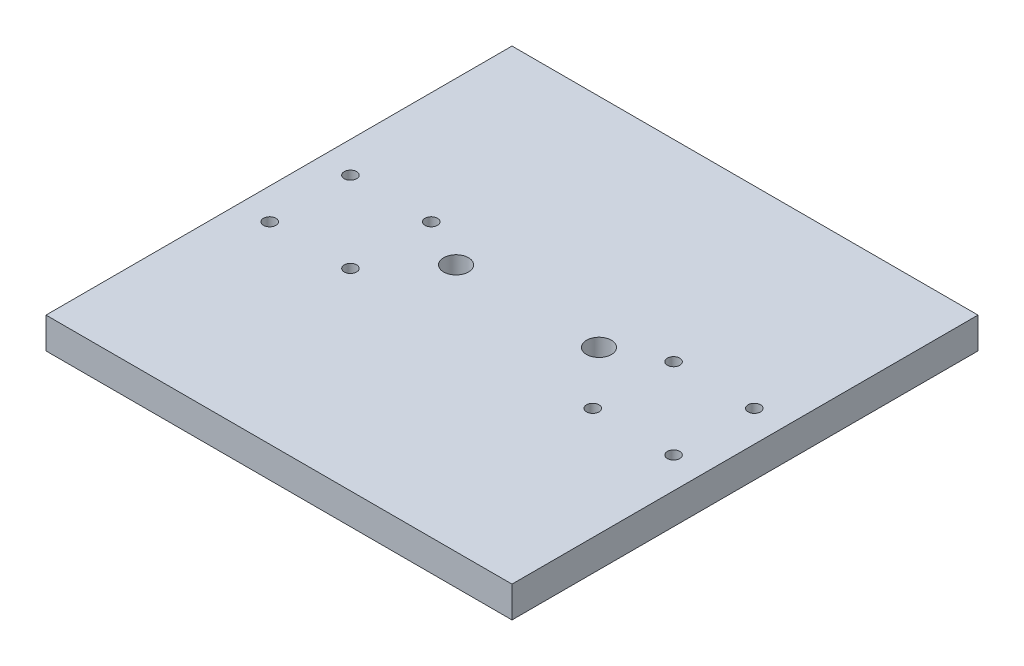
ISO-10303-21;
HEADER;
FILE_DESCRIPTION(('STEP AP214'),'2;1');
FILE_NAME('part.step','',(''),(''),'','','');
FILE_SCHEMA(('AUTOMOTIVE_DESIGN { 1 0 10303 214 1 1 1 1 }'));
ENDSEC;
DATA;
#1=APPLICATION_CONTEXT('core data for automotive mechanical design processes');
#2=APPLICATION_PROTOCOL_DEFINITION('international standard','automotive_design',2000,#1);
#3=PRODUCT_CONTEXT('',#1,'mechanical');
#4=PRODUCT('Part','Part','',(#3));
#5=PRODUCT_RELATED_PRODUCT_CATEGORY('part','',(#4));
#6=PRODUCT_DEFINITION_FORMATION('','',#4);
#7=PRODUCT_DEFINITION_CONTEXT('part definition',#1,'design');
#8=PRODUCT_DEFINITION('design','',#6,#7);
#9=PRODUCT_DEFINITION_SHAPE('','',#8);
#10=(LENGTH_UNIT() NAMED_UNIT(*) SI_UNIT(.MILLI.,.METRE.));
#11=(NAMED_UNIT(*) PLANE_ANGLE_UNIT() SI_UNIT($,.RADIAN.));
#12=(NAMED_UNIT(*) SI_UNIT($,.STERADIAN.) SOLID_ANGLE_UNIT());
#13=UNCERTAINTY_MEASURE_WITH_UNIT(LENGTH_MEASURE(1.E-05),#10,'distance_accuracy_value','');
#14=(GEOMETRIC_REPRESENTATION_CONTEXT(3) GLOBAL_UNCERTAINTY_ASSIGNED_CONTEXT((#13)) GLOBAL_UNIT_ASSIGNED_CONTEXT((#10,
#11,#12)) REPRESENTATION_CONTEXT('',''));
#15=CARTESIAN_POINT('',(0.,0.,0.));
#16=DIRECTION('',(0.,0.,1.));
#17=DIRECTION('',(1.,0.,0.));
#18=AXIS2_PLACEMENT_3D('',#15,#16,#17);
#19=CARTESIAN_POINT('',(75.,10.,-75.));
#20=DIRECTION('',(-1.,0.,0.));
#21=DIRECTION('',(0.,0.,1.));
#22=AXIS2_PLACEMENT_3D('',#19,#20,#21);
#23=PLANE('',#22);
#24=DIRECTION('',(0.,0.,-1.));
#25=VECTOR('',#24,1.);
#26=CARTESIAN_POINT('',(75.,0.,-75.));
#27=LINE('',#26,#25);
#28=CARTESIAN_POINT('',(75.,0.,75.));
#29=VERTEX_POINT('',#28);
#30=CARTESIAN_POINT('',(75.,0.,-75.));
#31=VERTEX_POINT('',#30);
#32=EDGE_CURVE('E101',#29,#31,#27,.T.);
#33=ORIENTED_EDGE('',*,*,#32,.T.);
#34=DIRECTION('',(0.,-1.,0.));
#35=VECTOR('',#34,1.);
#36=CARTESIAN_POINT('',(75.,10.,-75.));
#37=LINE('',#36,#35);
#38=CARTESIAN_POINT('',(75.,10.,-75.));
#39=VERTEX_POINT('',#38);
#40=EDGE_CURVE('E11',#39,#31,#37,.T.);
#41=ORIENTED_EDGE('',*,*,#40,.F.);
#42=DIRECTION('',(0.,0.,-1.));
#43=VECTOR('',#42,1.);
#44=CARTESIAN_POINT('',(75.,10.,-75.));
#45=LINE('',#44,#43);
#46=CARTESIAN_POINT('',(75.,10.,75.));
#47=VERTEX_POINT('',#46);
#48=EDGE_CURVE('E89',#47,#39,#45,.T.);
#49=ORIENTED_EDGE('',*,*,#48,.F.);
#50=DIRECTION('',(0.,-1.,0.));
#51=VECTOR('',#50,1.);
#52=CARTESIAN_POINT('',(75.,10.,75.));
#53=LINE('',#52,#51);
#54=EDGE_CURVE('E97',#47,#29,#53,.T.);
#55=ORIENTED_EDGE('',*,*,#54,.T.);
#56=EDGE_LOOP('',(#33,#41,#49,#55));
#57=FACE_BOUND('',#56,.T.);
#58=ADVANCED_FACE('F38',(#57),#23,.F.);
#59=CARTESIAN_POINT('',(-75.,10.,-75.));
#60=DIRECTION('',(0.,0.,1.));
#61=DIRECTION('',(1.,0.,0.));
#62=AXIS2_PLACEMENT_3D('',#59,#60,#61);
#63=PLANE('',#62);
#64=DIRECTION('',(-1.,0.,0.));
#65=VECTOR('',#64,1.);
#66=CARTESIAN_POINT('',(-75.,0.,-75.));
#67=LINE('',#66,#65);
#68=CARTESIAN_POINT('',(-75.,0.,-75.));
#69=VERTEX_POINT('',#68);
#70=EDGE_CURVE('E93',#31,#69,#67,.T.);
#71=ORIENTED_EDGE('',*,*,#70,.T.);
#72=DIRECTION('',(0.,-1.,0.));
#73=VECTOR('',#72,1.);
#74=CARTESIAN_POINT('',(-75.,10.,-75.));
#75=LINE('',#74,#73);
#76=CARTESIAN_POINT('',(-75.,10.,-75.));
#77=VERTEX_POINT('',#76);
#78=EDGE_CURVE('E46',#77,#69,#75,.T.);
#79=ORIENTED_EDGE('',*,*,#78,.F.);
#80=DIRECTION('',(-1.,0.,0.));
#81=VECTOR('',#80,1.);
#82=CARTESIAN_POINT('',(-75.,10.,-75.));
#83=LINE('',#82,#81);
#84=EDGE_CURVE('E84',#39,#77,#83,.T.);
#85=ORIENTED_EDGE('',*,*,#84,.F.);
#86=ORIENTED_EDGE('',*,*,#40,.T.);
#87=EDGE_LOOP('',(#71,#79,#85,#86));
#88=FACE_BOUND('',#87,.T.);
#89=ADVANCED_FACE('F92',(#88),#63,.F.);
#90=CARTESIAN_POINT('',(-75.,10.,-75.));
#91=DIRECTION('',(1.,0.,0.));
#92=DIRECTION('',(0.,0.,-1.));
#93=AXIS2_PLACEMENT_3D('',#90,#91,#92);
#94=PLANE('',#93);
#95=DIRECTION('',(0.,0.,1.));
#96=VECTOR('',#95,1.);
#97=CARTESIAN_POINT('',(-75.,0.,-75.));
#98=LINE('',#97,#96);
#99=CARTESIAN_POINT('',(-75.,0.,75.));
#100=VERTEX_POINT('',#99);
#101=EDGE_CURVE('E71',#69,#100,#98,.T.);
#102=ORIENTED_EDGE('',*,*,#101,.T.);
#103=DIRECTION('',(0.,-1.,0.));
#104=VECTOR('',#103,1.);
#105=CARTESIAN_POINT('',(-75.,10.,75.));
#106=LINE('',#105,#104);
#107=CARTESIAN_POINT('',(-75.,10.,75.));
#108=VERTEX_POINT('',#107);
#109=EDGE_CURVE('E94',#108,#100,#106,.T.);
#110=ORIENTED_EDGE('',*,*,#109,.F.);
#111=DIRECTION('',(0.,0.,1.));
#112=VECTOR('',#111,1.);
#113=CARTESIAN_POINT('',(-75.,10.,-75.));
#114=LINE('',#113,#112);
#115=EDGE_CURVE('E87',#77,#108,#114,.T.);
#116=ORIENTED_EDGE('',*,*,#115,.F.);
#117=ORIENTED_EDGE('',*,*,#78,.T.);
#118=EDGE_LOOP('',(#102,#110,#116,#117));
#119=FACE_BOUND('',#118,.T.);
#120=ADVANCED_FACE('F95',(#119),#94,.F.);
#121=CARTESIAN_POINT('',(-75.,10.,75.));
#122=DIRECTION('',(0.,0.,-1.));
#123=DIRECTION('',(-1.,0.,0.));
#124=AXIS2_PLACEMENT_3D('',#121,#122,#123);
#125=PLANE('',#124);
#126=DIRECTION('',(1.,0.,0.));
#127=VECTOR('',#126,1.);
#128=CARTESIAN_POINT('',(-75.,0.,75.));
#129=LINE('',#128,#127);
#130=EDGE_CURVE('E77',#100,#29,#129,.T.);
#131=ORIENTED_EDGE('',*,*,#130,.T.);
#132=ORIENTED_EDGE('',*,*,#54,.F.);
#133=DIRECTION('',(1.,0.,0.));
#134=VECTOR('',#133,1.);
#135=CARTESIAN_POINT('',(-75.,10.,75.));
#136=LINE('',#135,#134);
#137=EDGE_CURVE('E54',#108,#47,#136,.T.);
#138=ORIENTED_EDGE('',*,*,#137,.F.);
#139=ORIENTED_EDGE('',*,*,#109,.T.);
#140=EDGE_LOOP('',(#131,#132,#138,#139));
#141=FACE_BOUND('',#140,.T.);
#142=ADVANCED_FACE('F109',(#141),#125,.F.);
#143=CARTESIAN_POINT('',(0.,10.,0.));
#144=DIRECTION('',(0.,1.,0.));
#145=DIRECTION('',(0.,0.,1.));
#146=AXIS2_PLACEMENT_3D('',#143,#144,#145);
#147=PLANE('',#146);
#148=CARTESIAN_POINT('',(64.9999999999999,10.,13.));
#149=DIRECTION('',(0.,1.,0.));
#150=DIRECTION('',(0.,0.,1.));
#151=AXIS2_PLACEMENT_3D('',#148,#149,#150);
#152=CIRCLE('',#151,2.);
#153=CARTESIAN_POINT('',(64.9999999999999,10.,15.));
#154=VERTEX_POINT('',#153);
#155=EDGE_CURVE('E145',#154,#154,#152,.T.);
#156=ORIENTED_EDGE('',*,*,#155,.F.);
#157=EDGE_LOOP('',(#156));
#158=FACE_BOUND('',#157,.T.);
#159=CARTESIAN_POINT('',(64.9999999999999,10.,-13.));
#160=DIRECTION('',(0.,1.,0.));
#161=DIRECTION('',(0.,0.,1.));
#162=AXIS2_PLACEMENT_3D('',#159,#160,#161);
#163=CIRCLE('',#162,2.);
#164=CARTESIAN_POINT('',(64.9999999999999,10.,-11.));
#165=VERTEX_POINT('',#164);
#166=EDGE_CURVE('E152',#165,#165,#163,.T.);
#167=ORIENTED_EDGE('',*,*,#166,.F.);
#168=EDGE_LOOP('',(#167));
#169=FACE_BOUND('',#168,.T.);
#170=CARTESIAN_POINT('',(39.,10.,-13.));
#171=DIRECTION('',(0.,1.,0.));
#172=DIRECTION('',(0.,0.,1.));
#173=AXIS2_PLACEMENT_3D('',#170,#171,#172);
#174=CIRCLE('',#173,2.);
#175=CARTESIAN_POINT('',(39.,10.,-11.));
#176=VERTEX_POINT('',#175);
#177=EDGE_CURVE('E158',#176,#176,#174,.T.);
#178=ORIENTED_EDGE('',*,*,#177,.F.);
#179=EDGE_LOOP('',(#178));
#180=FACE_BOUND('',#179,.T.);
#181=CARTESIAN_POINT('',(-39.,10.,13.));
#182=DIRECTION('',(0.,1.,0.));
#183=DIRECTION('',(0.,0.,1.));
#184=AXIS2_PLACEMENT_3D('',#181,#182,#183);
#185=CIRCLE('',#184,2.);
#186=CARTESIAN_POINT('',(-39.,10.,15.));
#187=VERTEX_POINT('',#186);
#188=EDGE_CURVE('E164',#187,#187,#185,.T.);
#189=ORIENTED_EDGE('',*,*,#188,.F.);
#190=EDGE_LOOP('',(#189));
#191=FACE_BOUND('',#190,.T.);
#192=CARTESIAN_POINT('',(-23.,10.,-4.99999999999999));
#193=DIRECTION('',(0.,1.,0.));
#194=DIRECTION('',(0.,0.,-1.));
#195=AXIS2_PLACEMENT_3D('',#192,#193,#194);
#196=CIRCLE('',#195,4.);
#197=CARTESIAN_POINT('',(-23.,10.,-8.99999999999999));
#198=VERTEX_POINT('',#197);
#199=EDGE_CURVE('E128',#198,#198,#196,.T.);
#200=ORIENTED_EDGE('',*,*,#199,.F.);
#201=EDGE_LOOP('',(#200));
#202=FACE_BOUND('',#201,.T.);
#203=CARTESIAN_POINT('',(-64.9999999999999,10.,-13.));
#204=DIRECTION('',(0.,1.,0.));
#205=DIRECTION('',(0.,0.,1.));
#206=AXIS2_PLACEMENT_3D('',#203,#204,#205);
#207=CIRCLE('',#206,2.);
#208=CARTESIAN_POINT('',(-64.9999999999999,10.,-11.));
#209=VERTEX_POINT('',#208);
#210=EDGE_CURVE('E121',#209,#209,#207,.T.);
#211=ORIENTED_EDGE('',*,*,#210,.F.);
#212=EDGE_LOOP('',(#211));
#213=FACE_BOUND('',#212,.T.);
#214=CARTESIAN_POINT('',(-39.,10.,-13.));
#215=DIRECTION('',(0.,1.,0.));
#216=DIRECTION('',(0.,0.,1.));
#217=AXIS2_PLACEMENT_3D('',#214,#215,#216);
#218=CIRCLE('',#217,2.);
#219=CARTESIAN_POINT('',(-39.,10.,-11.));
#220=VERTEX_POINT('',#219);
#221=EDGE_CURVE('E140',#220,#220,#218,.T.);
#222=ORIENTED_EDGE('',*,*,#221,.F.);
#223=EDGE_LOOP('',(#222));
#224=FACE_BOUND('',#223,.T.);
#225=CARTESIAN_POINT('',(-64.9999999999999,10.,13.));
#226=DIRECTION('',(0.,1.,0.));
#227=DIRECTION('',(0.,0.,1.));
#228=AXIS2_PLACEMENT_3D('',#225,#226,#227);
#229=CIRCLE('',#228,2.);
#230=CARTESIAN_POINT('',(-64.9999999999999,10.,15.));
#231=VERTEX_POINT('',#230);
#232=EDGE_CURVE('E133',#231,#231,#229,.T.);
#233=ORIENTED_EDGE('',*,*,#232,.F.);
#234=EDGE_LOOP('',(#233));
#235=FACE_BOUND('',#234,.T.);
#236=CARTESIAN_POINT('',(39.,10.,13.));
#237=DIRECTION('',(0.,1.,0.));
#238=DIRECTION('',(0.,0.,1.));
#239=AXIS2_PLACEMENT_3D('',#236,#237,#238);
#240=CIRCLE('',#239,2.);
#241=CARTESIAN_POINT('',(39.,10.,15.));
#242=VERTEX_POINT('',#241);
#243=EDGE_CURVE('E169',#242,#242,#240,.T.);
#244=ORIENTED_EDGE('',*,*,#243,.F.);
#245=EDGE_LOOP('',(#244));
#246=FACE_BOUND('',#245,.T.);
#247=CARTESIAN_POINT('',(23.,10.,-4.99999999999999));
#248=DIRECTION('',(0.,1.,0.));
#249=DIRECTION('',(0.,0.,1.));
#250=AXIS2_PLACEMENT_3D('',#247,#248,#249);
#251=CIRCLE('',#250,4.);
#252=CARTESIAN_POINT('',(23.,10.,-0.999999999999991));
#253=VERTEX_POINT('',#252);
#254=EDGE_CURVE('E115',#253,#253,#251,.T.);
#255=ORIENTED_EDGE('',*,*,#254,.F.);
#256=EDGE_LOOP('',(#255));
#257=FACE_BOUND('',#256,.T.);
#258=ORIENTED_EDGE('',*,*,#48,.T.);
#259=ORIENTED_EDGE('',*,*,#84,.T.);
#260=ORIENTED_EDGE('',*,*,#115,.T.);
#261=ORIENTED_EDGE('',*,*,#137,.T.);
#262=EDGE_LOOP('',(#258,#259,#260,#261));
#263=FACE_BOUND('',#262,.T.);
#264=ADVANCED_FACE('F85',(#158,#169,#180,#191,#202,#213,#224,#235,#246,#257,#263),#147,.T.);
#265=CARTESIAN_POINT('',(0.,0.,0.));
#266=DIRECTION('',(0.,1.,0.));
#267=DIRECTION('',(0.,0.,1.));
#268=AXIS2_PLACEMENT_3D('',#265,#266,#267);
#269=PLANE('',#268);
#270=CARTESIAN_POINT('',(64.9999999999999,0.,13.));
#271=DIRECTION('',(0.,1.,0.));
#272=DIRECTION('',(0.,0.,1.));
#273=AXIS2_PLACEMENT_3D('',#270,#271,#272);
#274=CIRCLE('',#273,2.);
#275=CARTESIAN_POINT('',(64.9999999999999,0.,15.));
#276=VERTEX_POINT('',#275);
#277=EDGE_CURVE('E148',#276,#276,#274,.T.);
#278=ORIENTED_EDGE('',*,*,#277,.T.);
#279=EDGE_LOOP('',(#278));
#280=FACE_BOUND('',#279,.T.);
#281=CARTESIAN_POINT('',(64.9999999999999,0.,-13.));
#282=DIRECTION('',(0.,1.,0.));
#283=DIRECTION('',(0.,0.,1.));
#284=AXIS2_PLACEMENT_3D('',#281,#282,#283);
#285=CIRCLE('',#284,2.);
#286=CARTESIAN_POINT('',(64.9999999999999,0.,-11.));
#287=VERTEX_POINT('',#286);
#288=EDGE_CURVE('E155',#287,#287,#285,.T.);
#289=ORIENTED_EDGE('',*,*,#288,.T.);
#290=EDGE_LOOP('',(#289));
#291=FACE_BOUND('',#290,.T.);
#292=CARTESIAN_POINT('',(39.,0.,-13.));
#293=DIRECTION('',(0.,1.,0.));
#294=DIRECTION('',(0.,0.,1.));
#295=AXIS2_PLACEMENT_3D('',#292,#293,#294);
#296=CIRCLE('',#295,2.);
#297=CARTESIAN_POINT('',(39.,0.,-11.));
#298=VERTEX_POINT('',#297);
#299=EDGE_CURVE('E161',#298,#298,#296,.T.);
#300=ORIENTED_EDGE('',*,*,#299,.T.);
#301=EDGE_LOOP('',(#300));
#302=FACE_BOUND('',#301,.T.);
#303=CARTESIAN_POINT('',(-39.,0.,13.));
#304=DIRECTION('',(0.,1.,0.));
#305=DIRECTION('',(0.,0.,1.));
#306=AXIS2_PLACEMENT_3D('',#303,#304,#305);
#307=CIRCLE('',#306,2.);
#308=CARTESIAN_POINT('',(-39.,0.,15.));
#309=VERTEX_POINT('',#308);
#310=EDGE_CURVE('E137',#309,#309,#307,.T.);
#311=ORIENTED_EDGE('',*,*,#310,.T.);
#312=EDGE_LOOP('',(#311));
#313=FACE_BOUND('',#312,.T.);
#314=CARTESIAN_POINT('',(-23.,0.,-4.99999999999999));
#315=DIRECTION('',(0.,1.,0.));
#316=DIRECTION('',(0.,0.,-1.));
#317=AXIS2_PLACEMENT_3D('',#314,#315,#316);
#318=CIRCLE('',#317,4.);
#319=CARTESIAN_POINT('',(-23.,0.,-8.99999999999999));
#320=VERTEX_POINT('',#319);
#321=EDGE_CURVE('E118',#320,#320,#318,.T.);
#322=ORIENTED_EDGE('',*,*,#321,.T.);
#323=EDGE_LOOP('',(#322));
#324=FACE_BOUND('',#323,.T.);
#325=CARTESIAN_POINT('',(-64.9999999999999,0.,-13.));
#326=DIRECTION('',(0.,1.,0.));
#327=DIRECTION('',(0.,0.,1.));
#328=AXIS2_PLACEMENT_3D('',#325,#326,#327);
#329=CIRCLE('',#328,2.);
#330=CARTESIAN_POINT('',(-64.9999999999999,0.,-11.));
#331=VERTEX_POINT('',#330);
#332=EDGE_CURVE('E124',#331,#331,#329,.T.);
#333=ORIENTED_EDGE('',*,*,#332,.T.);
#334=EDGE_LOOP('',(#333));
#335=FACE_BOUND('',#334,.T.);
#336=CARTESIAN_POINT('',(-39.,0.,-13.));
#337=DIRECTION('',(0.,1.,0.));
#338=DIRECTION('',(0.,0.,1.));
#339=AXIS2_PLACEMENT_3D('',#336,#337,#338);
#340=CIRCLE('',#339,2.);
#341=CARTESIAN_POINT('',(-39.,0.,-11.));
#342=VERTEX_POINT('',#341);
#343=EDGE_CURVE('E125',#342,#342,#340,.T.);
#344=ORIENTED_EDGE('',*,*,#343,.T.);
#345=EDGE_LOOP('',(#344));
#346=FACE_BOUND('',#345,.T.);
#347=CARTESIAN_POINT('',(-64.9999999999999,0.,13.));
#348=DIRECTION('',(0.,1.,0.));
#349=DIRECTION('',(0.,0.,1.));
#350=AXIS2_PLACEMENT_3D('',#347,#348,#349);
#351=CIRCLE('',#350,2.);
#352=CARTESIAN_POINT('',(-64.9999999999999,0.,15.));
#353=VERTEX_POINT('',#352);
#354=EDGE_CURVE('E136',#353,#353,#351,.T.);
#355=ORIENTED_EDGE('',*,*,#354,.T.);
#356=EDGE_LOOP('',(#355));
#357=FACE_BOUND('',#356,.T.);
#358=CARTESIAN_POINT('',(39.,0.,13.));
#359=DIRECTION('',(0.,1.,0.));
#360=DIRECTION('',(0.,0.,1.));
#361=AXIS2_PLACEMENT_3D('',#358,#359,#360);
#362=CIRCLE('',#361,2.);
#363=CARTESIAN_POINT('',(39.,0.,15.));
#364=VERTEX_POINT('',#363);
#365=EDGE_CURVE('E149',#364,#364,#362,.T.);
#366=ORIENTED_EDGE('',*,*,#365,.T.);
#367=EDGE_LOOP('',(#366));
#368=FACE_BOUND('',#367,.T.);
#369=CARTESIAN_POINT('',(23.,0.,-4.99999999999999));
#370=DIRECTION('',(0.,1.,0.));
#371=DIRECTION('',(0.,0.,1.));
#372=AXIS2_PLACEMENT_3D('',#369,#370,#371);
#373=CIRCLE('',#372,4.);
#374=CARTESIAN_POINT('',(23.,0.,-0.999999999999991));
#375=VERTEX_POINT('',#374);
#376=EDGE_CURVE('E104',#375,#375,#373,.T.);
#377=ORIENTED_EDGE('',*,*,#376,.T.);
#378=EDGE_LOOP('',(#377));
#379=FACE_BOUND('',#378,.T.);
#380=ORIENTED_EDGE('',*,*,#32,.F.);
#381=ORIENTED_EDGE('',*,*,#130,.F.);
#382=ORIENTED_EDGE('',*,*,#101,.F.);
#383=ORIENTED_EDGE('',*,*,#70,.F.);
#384=EDGE_LOOP('',(#380,#381,#382,#383));
#385=FACE_BOUND('',#384,.T.);
#386=ADVANCED_FACE('F112',(#280,#291,#302,#313,#324,#335,#346,#357,#368,#379,#385),#269,.F.);
#387=CARTESIAN_POINT('',(23.,0.,-4.99999999999999));
#388=DIRECTION('',(0.,1.,0.));
#389=DIRECTION('',(0.,0.,1.));
#390=AXIS2_PLACEMENT_3D('',#387,#388,#389);
#391=CYLINDRICAL_SURFACE('',#390,4.);
#392=ORIENTED_EDGE('',*,*,#376,.F.);
#393=EDGE_LOOP('',(#392));
#394=FACE_BOUND('',#393,.T.);
#395=ORIENTED_EDGE('',*,*,#254,.T.);
#396=EDGE_LOOP('',(#395));
#397=FACE_BOUND('',#396,.T.);
#398=ADVANCED_FACE('F181',(#394,#397),#391,.F.);
#399=CARTESIAN_POINT('',(39.,0.,13.));
#400=DIRECTION('',(0.,1.,0.));
#401=DIRECTION('',(0.,0.,1.));
#402=AXIS2_PLACEMENT_3D('',#399,#400,#401);
#403=CYLINDRICAL_SURFACE('',#402,2.);
#404=ORIENTED_EDGE('',*,*,#365,.F.);
#405=EDGE_LOOP('',(#404));
#406=FACE_BOUND('',#405,.T.);
#407=ORIENTED_EDGE('',*,*,#243,.T.);
#408=EDGE_LOOP('',(#407));
#409=FACE_BOUND('',#408,.T.);
#410=ADVANCED_FACE('F177',(#406,#409),#403,.F.);
#411=CARTESIAN_POINT('',(-64.9999999999999,0.,13.));
#412=DIRECTION('',(0.,1.,0.));
#413=DIRECTION('',(0.,0.,1.));
#414=AXIS2_PLACEMENT_3D('',#411,#412,#413);
#415=CYLINDRICAL_SURFACE('',#414,2.);
#416=ORIENTED_EDGE('',*,*,#354,.F.);
#417=EDGE_LOOP('',(#416));
#418=FACE_BOUND('',#417,.T.);
#419=ORIENTED_EDGE('',*,*,#232,.T.);
#420=EDGE_LOOP('',(#419));
#421=FACE_BOUND('',#420,.T.);
#422=ADVANCED_FACE('F180',(#418,#421),#415,.F.);
#423=CARTESIAN_POINT('',(-39.,0.,-13.));
#424=DIRECTION('',(0.,1.,0.));
#425=DIRECTION('',(0.,0.,1.));
#426=AXIS2_PLACEMENT_3D('',#423,#424,#425);
#427=CYLINDRICAL_SURFACE('',#426,2.);
#428=ORIENTED_EDGE('',*,*,#343,.F.);
#429=EDGE_LOOP('',(#428));
#430=FACE_BOUND('',#429,.T.);
#431=ORIENTED_EDGE('',*,*,#221,.T.);
#432=EDGE_LOOP('',(#431));
#433=FACE_BOUND('',#432,.T.);
#434=ADVANCED_FACE('F244',(#430,#433),#427,.F.);
#435=CARTESIAN_POINT('',(-64.9999999999999,0.,-13.));
#436=DIRECTION('',(0.,1.,0.));
#437=DIRECTION('',(0.,0.,1.));
#438=AXIS2_PLACEMENT_3D('',#435,#436,#437);
#439=CYLINDRICAL_SURFACE('',#438,2.);
#440=ORIENTED_EDGE('',*,*,#332,.F.);
#441=EDGE_LOOP('',(#440));
#442=FACE_BOUND('',#441,.T.);
#443=ORIENTED_EDGE('',*,*,#210,.T.);
#444=EDGE_LOOP('',(#443));
#445=FACE_BOUND('',#444,.T.);
#446=ADVANCED_FACE('F254',(#442,#445),#439,.F.);
#447=CARTESIAN_POINT('',(-23.,0.,-4.99999999999999));
#448=DIRECTION('',(0.,1.,0.));
#449=DIRECTION('',(0.,0.,1.));
#450=AXIS2_PLACEMENT_3D('',#447,#448,#449);
#451=CYLINDRICAL_SURFACE('',#450,4.);
#452=ORIENTED_EDGE('',*,*,#321,.F.);
#453=EDGE_LOOP('',(#452));
#454=FACE_BOUND('',#453,.T.);
#455=ORIENTED_EDGE('',*,*,#199,.T.);
#456=EDGE_LOOP('',(#455));
#457=FACE_BOUND('',#456,.T.);
#458=ADVANCED_FACE('F264',(#454,#457),#451,.F.);
#459=CARTESIAN_POINT('',(-39.,0.,13.));
#460=DIRECTION('',(0.,1.,0.));
#461=DIRECTION('',(0.,0.,1.));
#462=AXIS2_PLACEMENT_3D('',#459,#460,#461);
#463=CYLINDRICAL_SURFACE('',#462,2.);
#464=ORIENTED_EDGE('',*,*,#310,.F.);
#465=EDGE_LOOP('',(#464));
#466=FACE_BOUND('',#465,.T.);
#467=ORIENTED_EDGE('',*,*,#188,.T.);
#468=EDGE_LOOP('',(#467));
#469=FACE_BOUND('',#468,.T.);
#470=ADVANCED_FACE('F273',(#466,#469),#463,.F.);
#471=CARTESIAN_POINT('',(39.,0.,-13.));
#472=DIRECTION('',(0.,1.,0.));
#473=DIRECTION('',(0.,0.,1.));
#474=AXIS2_PLACEMENT_3D('',#471,#472,#473);
#475=CYLINDRICAL_SURFACE('',#474,2.);
#476=ORIENTED_EDGE('',*,*,#299,.F.);
#477=EDGE_LOOP('',(#476));
#478=FACE_BOUND('',#477,.T.);
#479=ORIENTED_EDGE('',*,*,#177,.T.);
#480=EDGE_LOOP('',(#479));
#481=FACE_BOUND('',#480,.T.);
#482=ADVANCED_FACE('F283',(#478,#481),#475,.F.);
#483=CARTESIAN_POINT('',(64.9999999999999,0.,-13.));
#484=DIRECTION('',(0.,1.,0.));
#485=DIRECTION('',(0.,0.,1.));
#486=AXIS2_PLACEMENT_3D('',#483,#484,#485);
#487=CYLINDRICAL_SURFACE('',#486,2.);
#488=ORIENTED_EDGE('',*,*,#288,.F.);
#489=EDGE_LOOP('',(#488));
#490=FACE_BOUND('',#489,.T.);
#491=ORIENTED_EDGE('',*,*,#166,.T.);
#492=EDGE_LOOP('',(#491));
#493=FACE_BOUND('',#492,.T.);
#494=ADVANCED_FACE('F293',(#490,#493),#487,.F.);
#495=CARTESIAN_POINT('',(64.9999999999999,0.,13.));
#496=DIRECTION('',(0.,1.,0.));
#497=DIRECTION('',(0.,0.,1.));
#498=AXIS2_PLACEMENT_3D('',#495,#496,#497);
#499=CYLINDRICAL_SURFACE('',#498,2.);
#500=ORIENTED_EDGE('',*,*,#277,.F.);
#501=EDGE_LOOP('',(#500));
#502=FACE_BOUND('',#501,.T.);
#503=ORIENTED_EDGE('',*,*,#155,.T.);
#504=EDGE_LOOP('',(#503));
#505=FACE_BOUND('',#504,.T.);
#506=ADVANCED_FACE('F303',(#502,#505),#499,.F.);
#507=CLOSED_SHELL('',(#58,#89,#120,#142,#264,#386,#398,#410,#422,#434,#446,#458,#470,#482,#494,#506));
#508=MANIFOLD_SOLID_BREP('B2',#507);
#509=ADVANCED_BREP_SHAPE_REPRESENTATION('',(#18,#508),#14);
#510=SHAPE_DEFINITION_REPRESENTATION(#9,#509);
ENDSEC;
END-ISO-10303-21;
